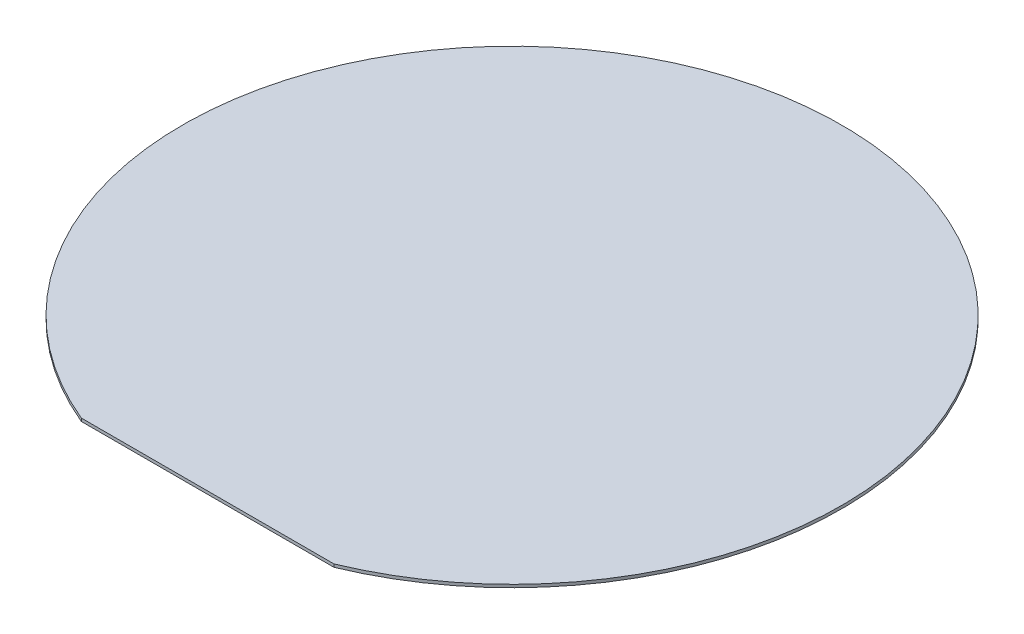
ISO-10303-21;
HEADER;
FILE_DESCRIPTION(('STEP AP214'),'2;1');
FILE_NAME('part.step','',(''),(''),'','','');
FILE_SCHEMA(('AUTOMOTIVE_DESIGN { 1 0 10303 214 1 1 1 1 }'));
ENDSEC;
DATA;
#1=APPLICATION_CONTEXT('core data for automotive mechanical design processes');
#2=APPLICATION_PROTOCOL_DEFINITION('international standard','automotive_design',2000,#1);
#3=PRODUCT_CONTEXT('',#1,'mechanical');
#4=PRODUCT('Part','Part','',(#3));
#5=PRODUCT_RELATED_PRODUCT_CATEGORY('part','',(#4));
#6=PRODUCT_DEFINITION_FORMATION('','',#4);
#7=PRODUCT_DEFINITION_CONTEXT('part definition',#1,'design');
#8=PRODUCT_DEFINITION('design','',#6,#7);
#9=PRODUCT_DEFINITION_SHAPE('','',#8);
#10=(LENGTH_UNIT() NAMED_UNIT(*) SI_UNIT(.MILLI.,.METRE.));
#11=(NAMED_UNIT(*) PLANE_ANGLE_UNIT() SI_UNIT($,.RADIAN.));
#12=(NAMED_UNIT(*) SI_UNIT($,.STERADIAN.) SOLID_ANGLE_UNIT());
#13=UNCERTAINTY_MEASURE_WITH_UNIT(LENGTH_MEASURE(1.E-05),#10,'distance_accuracy_value','');
#14=(GEOMETRIC_REPRESENTATION_CONTEXT(3) GLOBAL_UNCERTAINTY_ASSIGNED_CONTEXT((#13)) GLOBAL_UNIT_ASSIGNED_CONTEXT((#10,
#11,#12)) REPRESENTATION_CONTEXT('',''));
#15=CARTESIAN_POINT('',(0.,0.,0.));
#16=DIRECTION('',(0.,0.,1.));
#17=DIRECTION('',(1.,0.,0.));
#18=AXIS2_PLACEMENT_3D('',#15,#16,#17);
#19=CARTESIAN_POINT('',(0.,0.675,0.));
#20=DIRECTION('',(0.,-1.,0.));
#21=DIRECTION('',(0.,0.,-1.));
#22=AXIS2_PLACEMENT_3D('',#19,#20,#21);
#23=CYLINDRICAL_SURFACE('',#22,75.);
#24=CARTESIAN_POINT('',(0.,0.675,0.));
#25=DIRECTION('',(0.,1.,0.));
#26=DIRECTION('',(0.,0.,1.));
#27=AXIS2_PLACEMENT_3D('',#24,#25,#26);
#28=CIRCLE('',#27,75.);
#29=CARTESIAN_POINT('',(28.75,0.675,69.2707550124871));
#30=VERTEX_POINT('',#29);
#31=CARTESIAN_POINT('',(-28.75,0.675,69.2707550124871));
#32=VERTEX_POINT('',#31);
#33=EDGE_CURVE('E11',#30,#32,#28,.T.);
#34=ORIENTED_EDGE('',*,*,#33,.F.);
#35=DIRECTION('',(0.,1.,0.));
#36=VECTOR('',#35,1.);
#37=CARTESIAN_POINT('',(28.75,0.,69.2707550124871));
#38=LINE('',#37,#36);
#39=CARTESIAN_POINT('',(28.75,0.,69.2707550124871));
#40=VERTEX_POINT('',#39);
#41=EDGE_CURVE('E58',#40,#30,#38,.T.);
#42=ORIENTED_EDGE('',*,*,#41,.F.);
#43=CARTESIAN_POINT('',(0.,0.,0.));
#44=DIRECTION('',(0.,1.,0.));
#45=DIRECTION('',(0.,0.,1.));
#46=AXIS2_PLACEMENT_3D('',#43,#44,#45);
#47=CIRCLE('',#46,75.);
#48=CARTESIAN_POINT('',(-28.75,0.,69.2707550124871));
#49=VERTEX_POINT('',#48);
#50=EDGE_CURVE('E38',#40,#49,#47,.T.);
#51=ORIENTED_EDGE('',*,*,#50,.T.);
#52=DIRECTION('',(0.,1.,0.));
#53=VECTOR('',#52,1.);
#54=CARTESIAN_POINT('',(-28.75,0.,69.2707550124871));
#55=LINE('',#54,#53);
#56=EDGE_CURVE('E49',#49,#32,#55,.T.);
#57=ORIENTED_EDGE('',*,*,#56,.T.);
#58=EDGE_LOOP('',(#34,#42,#51,#57));
#59=FACE_BOUND('',#58,.T.);
#60=ADVANCED_FACE('F35',(#59),#23,.T.);
#61=CARTESIAN_POINT('',(0.,0.675,0.));
#62=DIRECTION('',(0.,1.,0.));
#63=DIRECTION('',(0.,0.,1.));
#64=AXIS2_PLACEMENT_3D('',#61,#62,#63);
#65=PLANE('',#64);
#66=DIRECTION('',(-1.,0.,0.));
#67=VECTOR('',#66,1.);
#68=CARTESIAN_POINT('',(-28.75,0.675,69.2707550124871));
#69=LINE('',#68,#67);
#70=EDGE_CURVE('E61',#30,#32,#69,.T.);
#71=ORIENTED_EDGE('',*,*,#70,.F.);
#72=ORIENTED_EDGE('',*,*,#33,.T.);
#73=EDGE_LOOP('',(#71,#72));
#74=FACE_BOUND('',#73,.T.);
#75=ADVANCED_FACE('F68',(#74),#65,.T.);
#76=CARTESIAN_POINT('',(0.,0.,0.));
#77=DIRECTION('',(0.,1.,0.));
#78=DIRECTION('',(0.,0.,1.));
#79=AXIS2_PLACEMENT_3D('',#76,#77,#78);
#80=PLANE('',#79);
#81=ORIENTED_EDGE('',*,*,#50,.F.);
#82=DIRECTION('',(-1.,0.,0.));
#83=VECTOR('',#82,1.);
#84=CARTESIAN_POINT('',(-28.75,0.,69.2707550124871));
#85=LINE('',#84,#83);
#86=EDGE_CURVE('E54',#40,#49,#85,.T.);
#87=ORIENTED_EDGE('',*,*,#86,.T.);
#88=EDGE_LOOP('',(#81,#87));
#89=FACE_BOUND('',#88,.T.);
#90=ADVANCED_FACE('F73',(#89),#80,.F.);
#91=CARTESIAN_POINT('',(-28.75,0.,69.2707550124871));
#92=DIRECTION('',(0.,0.,-1.));
#93=DIRECTION('',(-1.,0.,0.));
#94=AXIS2_PLACEMENT_3D('',#91,#92,#93);
#95=PLANE('',#94);
#96=ORIENTED_EDGE('',*,*,#70,.T.);
#97=ORIENTED_EDGE('',*,*,#56,.F.);
#98=ORIENTED_EDGE('',*,*,#86,.F.);
#99=ORIENTED_EDGE('',*,*,#41,.T.);
#100=EDGE_LOOP('',(#96,#97,#98,#99));
#101=FACE_BOUND('',#100,.T.);
#102=ADVANCED_FACE('F60',(#101),#95,.F.);
#103=CLOSED_SHELL('',(#60,#75,#90,#102));
#104=MANIFOLD_SOLID_BREP('B2',#103);
#105=ADVANCED_BREP_SHAPE_REPRESENTATION('',(#18,#104),#14);
#106=SHAPE_DEFINITION_REPRESENTATION(#9,#105);
ENDSEC;
END-ISO-10303-21;
